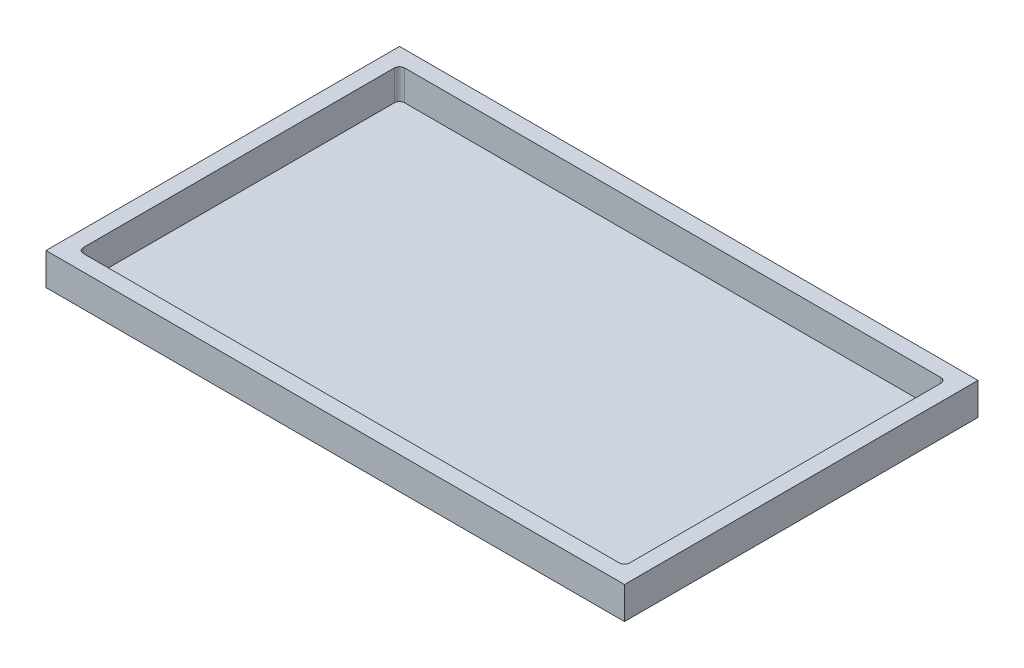
ISO-10303-21;
HEADER;
FILE_DESCRIPTION(('STEP AP214'),'2;1');
FILE_NAME('part.step','',(''),(''),'','','');
FILE_SCHEMA(('AUTOMOTIVE_DESIGN { 1 0 10303 214 1 1 1 1 }'));
ENDSEC;
DATA;
#1=APPLICATION_CONTEXT('core data for automotive mechanical design processes');
#2=APPLICATION_PROTOCOL_DEFINITION('international standard','automotive_design',2000,#1);
#3=PRODUCT_CONTEXT('',#1,'mechanical');
#4=PRODUCT('Part','Part','',(#3));
#5=PRODUCT_RELATED_PRODUCT_CATEGORY('part','',(#4));
#6=PRODUCT_DEFINITION_FORMATION('','',#4);
#7=PRODUCT_DEFINITION_CONTEXT('part definition',#1,'design');
#8=PRODUCT_DEFINITION('design','',#6,#7);
#9=PRODUCT_DEFINITION_SHAPE('','',#8);
#10=(LENGTH_UNIT() NAMED_UNIT(*) SI_UNIT(.MILLI.,.METRE.));
#11=(NAMED_UNIT(*) PLANE_ANGLE_UNIT() SI_UNIT($,.RADIAN.));
#12=(NAMED_UNIT(*) SI_UNIT($,.STERADIAN.) SOLID_ANGLE_UNIT());
#13=UNCERTAINTY_MEASURE_WITH_UNIT(LENGTH_MEASURE(1.E-05),#10,'distance_accuracy_value','');
#14=(GEOMETRIC_REPRESENTATION_CONTEXT(3) GLOBAL_UNCERTAINTY_ASSIGNED_CONTEXT((#13)) GLOBAL_UNIT_ASSIGNED_CONTEXT((#10,
#11,#12)) REPRESENTATION_CONTEXT('',''));
#15=CARTESIAN_POINT('',(0.,0.,0.));
#16=DIRECTION('',(0.,0.,1.));
#17=DIRECTION('',(1.,0.,0.));
#18=AXIS2_PLACEMENT_3D('',#15,#16,#17);
#19=CARTESIAN_POINT('',(450.,50.,275.));
#20=DIRECTION('',(-1.,0.,0.));
#21=DIRECTION('',(0.,0.,1.));
#22=AXIS2_PLACEMENT_3D('',#19,#20,#21);
#23=PLANE('',#22);
#24=DIRECTION('',(0.,0.,-1.));
#25=VECTOR('',#24,1.);
#26=CARTESIAN_POINT('',(450.,0.,275.));
#27=LINE('',#26,#25);
#28=CARTESIAN_POINT('',(450.,0.,275.));
#29=VERTEX_POINT('',#28);
#30=CARTESIAN_POINT('',(450.,0.,-275.));
#31=VERTEX_POINT('',#30);
#32=EDGE_CURVE('E146',#29,#31,#27,.T.);
#33=ORIENTED_EDGE('',*,*,#32,.T.);
#34=DIRECTION('',(0.,-1.,0.));
#35=VECTOR('',#34,1.);
#36=CARTESIAN_POINT('',(450.,50.,-275.));
#37=LINE('',#36,#35);
#38=CARTESIAN_POINT('',(450.,50.,-275.));
#39=VERTEX_POINT('',#38);
#40=EDGE_CURVE('E127',#39,#31,#37,.T.);
#41=ORIENTED_EDGE('',*,*,#40,.F.);
#42=DIRECTION('',(0.,0.,-1.));
#43=VECTOR('',#42,1.);
#44=CARTESIAN_POINT('',(450.,50.,275.));
#45=LINE('',#44,#43);
#46=CARTESIAN_POINT('',(450.,50.,275.));
#47=VERTEX_POINT('',#46);
#48=EDGE_CURVE('E134',#47,#39,#45,.T.);
#49=ORIENTED_EDGE('',*,*,#48,.F.);
#50=DIRECTION('',(0.,-1.,0.));
#51=VECTOR('',#50,1.);
#52=CARTESIAN_POINT('',(450.,50.,275.));
#53=LINE('',#52,#51);
#54=EDGE_CURVE('E223',#47,#29,#53,.T.);
#55=ORIENTED_EDGE('',*,*,#54,.T.);
#56=EDGE_LOOP('',(#33,#41,#49,#55));
#57=FACE_BOUND('',#56,.T.);
#58=ADVANCED_FACE('F35',(#57),#23,.F.);
#59=CARTESIAN_POINT('',(-450.,50.,-275.));
#60=DIRECTION('',(0.,0.,1.));
#61=DIRECTION('',(1.,0.,0.));
#62=AXIS2_PLACEMENT_3D('',#59,#60,#61);
#63=PLANE('',#62);
#64=DIRECTION('',(-1.,0.,0.));
#65=VECTOR('',#64,1.);
#66=CARTESIAN_POINT('',(-450.,0.,-275.));
#67=LINE('',#66,#65);
#68=CARTESIAN_POINT('',(-450.,0.,-275.));
#69=VERTEX_POINT('',#68);
#70=EDGE_CURVE('E210',#31,#69,#67,.T.);
#71=ORIENTED_EDGE('',*,*,#70,.T.);
#72=DIRECTION('',(0.,-1.,0.));
#73=VECTOR('',#72,1.);
#74=CARTESIAN_POINT('',(-450.,50.,-275.));
#75=LINE('',#74,#73);
#76=CARTESIAN_POINT('',(-450.,50.,-275.));
#77=VERTEX_POINT('',#76);
#78=EDGE_CURVE('E130',#77,#69,#75,.T.);
#79=ORIENTED_EDGE('',*,*,#78,.F.);
#80=DIRECTION('',(-1.,0.,0.));
#81=VECTOR('',#80,1.);
#82=CARTESIAN_POINT('',(-450.,50.,-275.));
#83=LINE('',#82,#81);
#84=EDGE_CURVE('E123',#39,#77,#83,.T.);
#85=ORIENTED_EDGE('',*,*,#84,.F.);
#86=ORIENTED_EDGE('',*,*,#40,.T.);
#87=EDGE_LOOP('',(#71,#79,#85,#86));
#88=FACE_BOUND('',#87,.T.);
#89=ADVANCED_FACE('F125',(#88),#63,.F.);
#90=CARTESIAN_POINT('',(-450.,50.,275.));
#91=DIRECTION('',(1.,0.,0.));
#92=DIRECTION('',(0.,0.,-1.));
#93=AXIS2_PLACEMENT_3D('',#90,#91,#92);
#94=PLANE('',#93);
#95=DIRECTION('',(0.,0.,1.));
#96=VECTOR('',#95,1.);
#97=CARTESIAN_POINT('',(-450.,0.,275.));
#98=LINE('',#97,#96);
#99=CARTESIAN_POINT('',(-450.,0.,275.));
#100=VERTEX_POINT('',#99);
#101=EDGE_CURVE('E226',#69,#100,#98,.T.);
#102=ORIENTED_EDGE('',*,*,#101,.T.);
#103=DIRECTION('',(0.,-1.,0.));
#104=VECTOR('',#103,1.);
#105=CARTESIAN_POINT('',(-450.,50.,275.));
#106=LINE('',#105,#104);
#107=CARTESIAN_POINT('',(-450.,50.,275.));
#108=VERTEX_POINT('',#107);
#109=EDGE_CURVE('E151',#108,#100,#106,.T.);
#110=ORIENTED_EDGE('',*,*,#109,.F.);
#111=DIRECTION('',(0.,0.,1.));
#112=VECTOR('',#111,1.);
#113=CARTESIAN_POINT('',(-450.,50.,275.));
#114=LINE('',#113,#112);
#115=EDGE_CURVE('E133',#77,#108,#114,.T.);
#116=ORIENTED_EDGE('',*,*,#115,.F.);
#117=ORIENTED_EDGE('',*,*,#78,.T.);
#118=EDGE_LOOP('',(#102,#110,#116,#117));
#119=FACE_BOUND('',#118,.T.);
#120=ADVANCED_FACE('F238',(#119),#94,.F.);
#121=CARTESIAN_POINT('',(-450.,50.,275.));
#122=DIRECTION('',(0.,0.,-1.));
#123=DIRECTION('',(-1.,0.,0.));
#124=AXIS2_PLACEMENT_3D('',#121,#122,#123);
#125=PLANE('',#124);
#126=DIRECTION('',(1.,0.,0.));
#127=VECTOR('',#126,1.);
#128=CARTESIAN_POINT('',(-450.,0.,275.));
#129=LINE('',#128,#127);
#130=EDGE_CURVE('E143',#100,#29,#129,.T.);
#131=ORIENTED_EDGE('',*,*,#130,.T.);
#132=ORIENTED_EDGE('',*,*,#54,.F.);
#133=DIRECTION('',(1.,0.,0.));
#134=VECTOR('',#133,1.);
#135=CARTESIAN_POINT('',(-450.,50.,275.));
#136=LINE('',#135,#134);
#137=EDGE_CURVE('E139',#108,#47,#136,.T.);
#138=ORIENTED_EDGE('',*,*,#137,.F.);
#139=ORIENTED_EDGE('',*,*,#109,.T.);
#140=EDGE_LOOP('',(#131,#132,#138,#139));
#141=FACE_BOUND('',#140,.T.);
#142=ADVANCED_FACE('F233',(#141),#125,.F.);
#143=CARTESIAN_POINT('',(0.,50.,0.));
#144=DIRECTION('',(0.,-1.,0.));
#145=DIRECTION('',(0.,0.,-1.));
#146=AXIS2_PLACEMENT_3D('',#143,#144,#145);
#147=PLANE('',#146);
#148=DIRECTION('',(0.,0.,-1.));
#149=VECTOR('',#148,1.);
#150=CARTESIAN_POINT('',(425.,50.,250.));
#151=LINE('',#150,#149);
#152=CARTESIAN_POINT('',(425.,50.,242.));
#153=VERTEX_POINT('',#152);
#154=CARTESIAN_POINT('',(425.,50.,-242.));
#155=VERTEX_POINT('',#154);
#156=EDGE_CURVE('E195',#153,#155,#151,.T.);
#157=ORIENTED_EDGE('',*,*,#156,.F.);
#158=CARTESIAN_POINT('',(417.,50.,242.));
#159=DIRECTION('',(0.,-1.,0.));
#160=DIRECTION('',(0.,0.,-1.));
#161=AXIS2_PLACEMENT_3D('',#158,#159,#160);
#162=CIRCLE('',#161,8.);
#163=CARTESIAN_POINT('',(417.,50.,250.));
#164=VERTEX_POINT('',#163);
#165=EDGE_CURVE('E11',#153,#164,#162,.T.);
#166=ORIENTED_EDGE('',*,*,#165,.T.);
#167=DIRECTION('',(1.,0.,0.));
#168=VECTOR('',#167,1.);
#169=CARTESIAN_POINT('',(-425.,50.,250.));
#170=LINE('',#169,#168);
#171=CARTESIAN_POINT('',(-417.,50.,250.));
#172=VERTEX_POINT('',#171);
#173=EDGE_CURVE('E216',#172,#164,#170,.T.);
#174=ORIENTED_EDGE('',*,*,#173,.F.);
#175=CARTESIAN_POINT('',(-417.,50.,242.));
#176=DIRECTION('',(0.,-1.,0.));
#177=DIRECTION('',(0.,0.,-1.));
#178=AXIS2_PLACEMENT_3D('',#175,#176,#177);
#179=CIRCLE('',#178,8.);
#180=CARTESIAN_POINT('',(-425.,50.,242.));
#181=VERTEX_POINT('',#180);
#182=EDGE_CURVE('E179',#172,#181,#179,.T.);
#183=ORIENTED_EDGE('',*,*,#182,.T.);
#184=DIRECTION('',(0.,0.,-1.));
#185=VECTOR('',#184,1.);
#186=CARTESIAN_POINT('',(-425.,50.,250.));
#187=LINE('',#186,#185);
#188=CARTESIAN_POINT('',(-425.,50.,-242.));
#189=VERTEX_POINT('',#188);
#190=EDGE_CURVE('E186',#181,#189,#187,.T.);
#191=ORIENTED_EDGE('',*,*,#190,.T.);
#192=CARTESIAN_POINT('',(-417.,50.,-242.));
#193=DIRECTION('',(0.,-1.,0.));
#194=DIRECTION('',(0.,0.,-1.));
#195=AXIS2_PLACEMENT_3D('',#192,#193,#194);
#196=CIRCLE('',#195,8.);
#197=CARTESIAN_POINT('',(-417.,50.,-250.));
#198=VERTEX_POINT('',#197);
#199=EDGE_CURVE('E181',#189,#198,#196,.T.);
#200=ORIENTED_EDGE('',*,*,#199,.T.);
#201=DIRECTION('',(1.,0.,0.));
#202=VECTOR('',#201,1.);
#203=CARTESIAN_POINT('',(-425.,50.,-250.));
#204=LINE('',#203,#202);
#205=CARTESIAN_POINT('',(417.,50.,-250.));
#206=VERTEX_POINT('',#205);
#207=EDGE_CURVE('E184',#198,#206,#204,.T.);
#208=ORIENTED_EDGE('',*,*,#207,.T.);
#209=CARTESIAN_POINT('',(417.,50.,-242.));
#210=DIRECTION('',(0.,-1.,0.));
#211=DIRECTION('',(0.,0.,-1.));
#212=AXIS2_PLACEMENT_3D('',#209,#210,#211);
#213=CIRCLE('',#212,8.);
#214=EDGE_CURVE('E43',#206,#155,#213,.T.);
#215=ORIENTED_EDGE('',*,*,#214,.T.);
#216=EDGE_LOOP('',(#157,#166,#174,#183,#191,#200,#208,#215));
#217=FACE_BOUND('',#216,.T.);
#218=ORIENTED_EDGE('',*,*,#48,.T.);
#219=ORIENTED_EDGE('',*,*,#84,.T.);
#220=ORIENTED_EDGE('',*,*,#115,.T.);
#221=ORIENTED_EDGE('',*,*,#137,.T.);
#222=EDGE_LOOP('',(#218,#219,#220,#221));
#223=FACE_BOUND('',#222,.T.);
#224=ADVANCED_FACE('F137',(#217,#223),#147,.F.);
#225=CARTESIAN_POINT('',(0.,0.,0.));
#226=DIRECTION('',(0.,-1.,0.));
#227=DIRECTION('',(0.,0.,-1.));
#228=AXIS2_PLACEMENT_3D('',#225,#226,#227);
#229=PLANE('',#228);
#230=ORIENTED_EDGE('',*,*,#32,.F.);
#231=ORIENTED_EDGE('',*,*,#130,.F.);
#232=ORIENTED_EDGE('',*,*,#101,.F.);
#233=ORIENTED_EDGE('',*,*,#70,.F.);
#234=EDGE_LOOP('',(#230,#231,#232,#233));
#235=FACE_BOUND('',#234,.T.);
#236=ADVANCED_FACE('F237',(#235),#229,.T.);
#237=CARTESIAN_POINT('',(-425.,3.,250.));
#238=DIRECTION('',(0.,0.,1.));
#239=DIRECTION('',(1.,0.,0.));
#240=AXIS2_PLACEMENT_3D('',#237,#238,#239);
#241=PLANE('',#240);
#242=DIRECTION('',(1.,0.,0.));
#243=VECTOR('',#242,1.);
#244=CARTESIAN_POINT('',(-425.,3.,250.));
#245=LINE('',#244,#243);
#246=CARTESIAN_POINT('',(-417.,3.,250.));
#247=VERTEX_POINT('',#246);
#248=CARTESIAN_POINT('',(417.,3.,250.));
#249=VERTEX_POINT('',#248);
#250=EDGE_CURVE('E220',#247,#249,#245,.T.);
#251=ORIENTED_EDGE('',*,*,#250,.F.);
#252=DIRECTION('',(0.,1.,0.));
#253=VECTOR('',#252,1.);
#254=CARTESIAN_POINT('',(-417.,3.,250.));
#255=LINE('',#254,#253);
#256=EDGE_CURVE('E149',#247,#172,#255,.T.);
#257=ORIENTED_EDGE('',*,*,#256,.T.);
#258=ORIENTED_EDGE('',*,*,#173,.T.);
#259=DIRECTION('',(0.,1.,0.));
#260=VECTOR('',#259,1.);
#261=CARTESIAN_POINT('',(417.,3.,250.));
#262=LINE('',#261,#260);
#263=EDGE_CURVE('E147',#164,#249,#262,.F.);
#264=ORIENTED_EDGE('',*,*,#263,.T.);
#265=EDGE_LOOP('',(#251,#257,#258,#264));
#266=FACE_BOUND('',#265,.T.);
#267=ADVANCED_FACE('F276',(#266),#241,.F.);
#268=CARTESIAN_POINT('',(-425.,3.,250.));
#269=DIRECTION('',(1.,0.,0.));
#270=DIRECTION('',(0.,0.,-1.));
#271=AXIS2_PLACEMENT_3D('',#268,#269,#270);
#272=PLANE('',#271);
#273=ORIENTED_EDGE('',*,*,#190,.F.);
#274=DIRECTION('',(0.,1.,0.));
#275=VECTOR('',#274,1.);
#276=CARTESIAN_POINT('',(-425.,3.,242.));
#277=LINE('',#276,#275);
#278=CARTESIAN_POINT('',(-425.,3.,242.));
#279=VERTEX_POINT('',#278);
#280=EDGE_CURVE('E160',#181,#279,#277,.F.);
#281=ORIENTED_EDGE('',*,*,#280,.T.);
#282=DIRECTION('',(0.,0.,-1.));
#283=VECTOR('',#282,1.);
#284=CARTESIAN_POINT('',(-425.,3.,250.));
#285=LINE('',#284,#283);
#286=CARTESIAN_POINT('',(-425.,3.,-242.));
#287=VERTEX_POINT('',#286);
#288=EDGE_CURVE('E203',#279,#287,#285,.T.);
#289=ORIENTED_EDGE('',*,*,#288,.T.);
#290=DIRECTION('',(0.,1.,0.));
#291=VECTOR('',#290,1.);
#292=CARTESIAN_POINT('',(-425.,50.,-242.));
#293=LINE('',#292,#291);
#294=EDGE_CURVE('E157',#287,#189,#293,.T.);
#295=ORIENTED_EDGE('',*,*,#294,.T.);
#296=EDGE_LOOP('',(#273,#281,#289,#295));
#297=FACE_BOUND('',#296,.T.);
#298=ADVANCED_FACE('F207',(#297),#272,.T.);
#299=CARTESIAN_POINT('',(-425.,3.,-250.));
#300=DIRECTION('',(0.,0.,1.));
#301=DIRECTION('',(1.,0.,0.));
#302=AXIS2_PLACEMENT_3D('',#299,#300,#301);
#303=PLANE('',#302);
#304=ORIENTED_EDGE('',*,*,#207,.F.);
#305=DIRECTION('',(0.,1.,0.));
#306=VECTOR('',#305,1.);
#307=CARTESIAN_POINT('',(-417.,3.,-250.));
#308=LINE('',#307,#306);
#309=CARTESIAN_POINT('',(-417.,3.,-250.));
#310=VERTEX_POINT('',#309);
#311=EDGE_CURVE('E173',#198,#310,#308,.F.);
#312=ORIENTED_EDGE('',*,*,#311,.T.);
#313=DIRECTION('',(1.,0.,0.));
#314=VECTOR('',#313,1.);
#315=CARTESIAN_POINT('',(-425.,3.,-250.));
#316=LINE('',#315,#314);
#317=CARTESIAN_POINT('',(417.,3.,-250.));
#318=VERTEX_POINT('',#317);
#319=EDGE_CURVE('E205',#310,#318,#316,.T.);
#320=ORIENTED_EDGE('',*,*,#319,.T.);
#321=DIRECTION('',(0.,1.,0.));
#322=VECTOR('',#321,1.);
#323=CARTESIAN_POINT('',(417.,3.,-250.));
#324=LINE('',#323,#322);
#325=EDGE_CURVE('E170',#318,#206,#324,.T.);
#326=ORIENTED_EDGE('',*,*,#325,.T.);
#327=EDGE_LOOP('',(#304,#312,#320,#326));
#328=FACE_BOUND('',#327,.T.);
#329=ADVANCED_FACE('F191',(#328),#303,.T.);
#330=CARTESIAN_POINT('',(425.,3.,250.));
#331=DIRECTION('',(1.,0.,0.));
#332=DIRECTION('',(0.,0.,-1.));
#333=AXIS2_PLACEMENT_3D('',#330,#331,#332);
#334=PLANE('',#333);
#335=ORIENTED_EDGE('',*,*,#156,.T.);
#336=DIRECTION('',(0.,1.,0.));
#337=VECTOR('',#336,1.);
#338=CARTESIAN_POINT('',(425.,3.,-242.));
#339=LINE('',#338,#337);
#340=CARTESIAN_POINT('',(425.,3.,-242.));
#341=VERTEX_POINT('',#340);
#342=EDGE_CURVE('E177',#155,#341,#339,.F.);
#343=ORIENTED_EDGE('',*,*,#342,.T.);
#344=DIRECTION('',(0.,0.,-1.));
#345=VECTOR('',#344,1.);
#346=CARTESIAN_POINT('',(425.,3.,250.));
#347=LINE('',#346,#345);
#348=CARTESIAN_POINT('',(425.,3.,242.));
#349=VERTEX_POINT('',#348);
#350=EDGE_CURVE('E212',#349,#341,#347,.T.);
#351=ORIENTED_EDGE('',*,*,#350,.F.);
#352=DIRECTION('',(0.,1.,0.));
#353=VECTOR('',#352,1.);
#354=CARTESIAN_POINT('',(425.,50.,242.));
#355=LINE('',#354,#353);
#356=EDGE_CURVE('E175',#349,#153,#355,.T.);
#357=ORIENTED_EDGE('',*,*,#356,.T.);
#358=EDGE_LOOP('',(#335,#343,#351,#357));
#359=FACE_BOUND('',#358,.T.);
#360=ADVANCED_FACE('F274',(#359),#334,.F.);
#361=CARTESIAN_POINT('',(0.,3.,0.));
#362=DIRECTION('',(0.,1.,0.));
#363=DIRECTION('',(0.,0.,1.));
#364=AXIS2_PLACEMENT_3D('',#361,#362,#363);
#365=PLANE('',#364);
#366=ORIENTED_EDGE('',*,*,#288,.F.);
#367=CARTESIAN_POINT('',(-417.,3.,242.));
#368=DIRECTION('',(0.,1.,0.));
#369=DIRECTION('',(0.,0.,1.));
#370=AXIS2_PLACEMENT_3D('',#367,#368,#369);
#371=CIRCLE('',#370,8.);
#372=EDGE_CURVE('E168',#279,#247,#371,.T.);
#373=ORIENTED_EDGE('',*,*,#372,.T.);
#374=ORIENTED_EDGE('',*,*,#250,.T.);
#375=CARTESIAN_POINT('',(417.,3.,242.));
#376=DIRECTION('',(0.,1.,0.));
#377=DIRECTION('',(0.,0.,1.));
#378=AXIS2_PLACEMENT_3D('',#375,#376,#377);
#379=CIRCLE('',#378,8.);
#380=EDGE_CURVE('E162',#249,#349,#379,.T.);
#381=ORIENTED_EDGE('',*,*,#380,.T.);
#382=ORIENTED_EDGE('',*,*,#350,.T.);
#383=CARTESIAN_POINT('',(417.,3.,-242.));
#384=DIRECTION('',(0.,1.,0.));
#385=DIRECTION('',(0.,0.,1.));
#386=AXIS2_PLACEMENT_3D('',#383,#384,#385);
#387=CIRCLE('',#386,8.);
#388=EDGE_CURVE('E164',#341,#318,#387,.T.);
#389=ORIENTED_EDGE('',*,*,#388,.T.);
#390=ORIENTED_EDGE('',*,*,#319,.F.);
#391=CARTESIAN_POINT('',(-417.,3.,-242.));
#392=DIRECTION('',(0.,1.,0.));
#393=DIRECTION('',(0.,0.,1.));
#394=AXIS2_PLACEMENT_3D('',#391,#392,#393);
#395=CIRCLE('',#394,8.);
#396=EDGE_CURVE('E166',#310,#287,#395,.T.);
#397=ORIENTED_EDGE('',*,*,#396,.T.);
#398=EDGE_LOOP('',(#366,#373,#374,#381,#382,#389,#390,#397));
#399=FACE_BOUND('',#398,.T.);
#400=ADVANCED_FACE('F202',(#399),#365,.T.);
#401=CARTESIAN_POINT('',(-417.,3.,242.));
#402=DIRECTION('',(0.,1.,0.));
#403=DIRECTION('',(0.,0.,1.));
#404=AXIS2_PLACEMENT_3D('',#401,#402,#403);
#405=CYLINDRICAL_SURFACE('',#404,8.);
#406=ORIENTED_EDGE('',*,*,#372,.F.);
#407=ORIENTED_EDGE('',*,*,#280,.F.);
#408=ORIENTED_EDGE('',*,*,#182,.F.);
#409=ORIENTED_EDGE('',*,*,#256,.F.);
#410=EDGE_LOOP('',(#406,#407,#408,#409));
#411=FACE_BOUND('',#410,.T.);
#412=ADVANCED_FACE('F252',(#411),#405,.F.);
#413=CARTESIAN_POINT('',(-417.,3.,-242.));
#414=DIRECTION('',(0.,-1.,0.));
#415=DIRECTION('',(0.,0.,-1.));
#416=AXIS2_PLACEMENT_3D('',#413,#414,#415);
#417=CYLINDRICAL_SURFACE('',#416,8.);
#418=ORIENTED_EDGE('',*,*,#396,.F.);
#419=ORIENTED_EDGE('',*,*,#311,.F.);
#420=ORIENTED_EDGE('',*,*,#199,.F.);
#421=ORIENTED_EDGE('',*,*,#294,.F.);
#422=EDGE_LOOP('',(#418,#419,#420,#421));
#423=FACE_BOUND('',#422,.T.);
#424=ADVANCED_FACE('F198',(#423),#417,.F.);
#425=CARTESIAN_POINT('',(417.,3.,-242.));
#426=DIRECTION('',(0.,1.,0.));
#427=DIRECTION('',(0.,0.,1.));
#428=AXIS2_PLACEMENT_3D('',#425,#426,#427);
#429=CYLINDRICAL_SURFACE('',#428,8.);
#430=ORIENTED_EDGE('',*,*,#388,.F.);
#431=ORIENTED_EDGE('',*,*,#342,.F.);
#432=ORIENTED_EDGE('',*,*,#214,.F.);
#433=ORIENTED_EDGE('',*,*,#325,.F.);
#434=EDGE_LOOP('',(#430,#431,#432,#433));
#435=FACE_BOUND('',#434,.T.);
#436=ADVANCED_FACE('F257',(#435),#429,.F.);
#437=CARTESIAN_POINT('',(417.,3.,242.));
#438=DIRECTION('',(0.,-1.,0.));
#439=DIRECTION('',(0.,0.,-1.));
#440=AXIS2_PLACEMENT_3D('',#437,#438,#439);
#441=CYLINDRICAL_SURFACE('',#440,8.);
#442=ORIENTED_EDGE('',*,*,#380,.F.);
#443=ORIENTED_EDGE('',*,*,#263,.F.);
#444=ORIENTED_EDGE('',*,*,#165,.F.);
#445=ORIENTED_EDGE('',*,*,#356,.F.);
#446=EDGE_LOOP('',(#442,#443,#444,#445));
#447=FACE_BOUND('',#446,.T.);
#448=ADVANCED_FACE('F37',(#447),#441,.F.);
#449=CLOSED_SHELL('',(#58,#89,#120,#142,#224,#236,#267,#298,#329,#360,#400,#412,#424,#436,#448));
#450=MANIFOLD_SOLID_BREP('B2',#449);
#451=ADVANCED_BREP_SHAPE_REPRESENTATION('',(#18,#450),#14);
#452=SHAPE_DEFINITION_REPRESENTATION(#9,#451);
ENDSEC;
END-ISO-10303-21;
